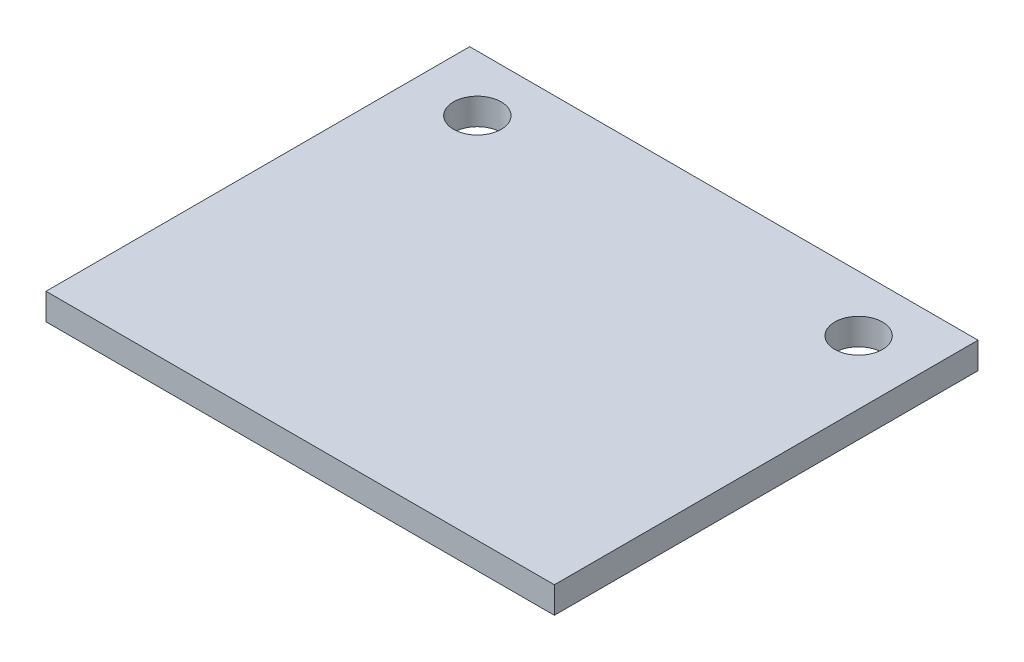
ISO-10303-21;
HEADER;
FILE_DESCRIPTION(('STEP AP214'),'2;1');
FILE_NAME('part.step','',(''),(''),'','','');
FILE_SCHEMA(('AUTOMOTIVE_DESIGN { 1 0 10303 214 1 1 1 1 }'));
ENDSEC;
DATA;
#1=APPLICATION_CONTEXT('core data for automotive mechanical design processes');
#2=APPLICATION_PROTOCOL_DEFINITION('international standard','automotive_design',2000,#1);
#3=PRODUCT_CONTEXT('',#1,'mechanical');
#4=PRODUCT('Part','Part','',(#3));
#5=PRODUCT_RELATED_PRODUCT_CATEGORY('part','',(#4));
#6=PRODUCT_DEFINITION_FORMATION('','',#4);
#7=PRODUCT_DEFINITION_CONTEXT('part definition',#1,'design');
#8=PRODUCT_DEFINITION('design','',#6,#7);
#9=PRODUCT_DEFINITION_SHAPE('','',#8);
#10=(LENGTH_UNIT() NAMED_UNIT(*) SI_UNIT(.MILLI.,.METRE.));
#11=(NAMED_UNIT(*) PLANE_ANGLE_UNIT() SI_UNIT($,.RADIAN.));
#12=(NAMED_UNIT(*) SI_UNIT($,.STERADIAN.) SOLID_ANGLE_UNIT());
#13=UNCERTAINTY_MEASURE_WITH_UNIT(LENGTH_MEASURE(1.E-05),#10,'distance_accuracy_value','');
#14=(GEOMETRIC_REPRESENTATION_CONTEXT(3) GLOBAL_UNCERTAINTY_ASSIGNED_CONTEXT((#13)) GLOBAL_UNIT_ASSIGNED_CONTEXT((#10,
#11,#12)) REPRESENTATION_CONTEXT('',''));
#15=CARTESIAN_POINT('',(0.,0.,0.));
#16=DIRECTION('',(0.,0.,1.));
#17=DIRECTION('',(1.,0.,0.));
#18=AXIS2_PLACEMENT_3D('',#15,#16,#17);
#19=CARTESIAN_POINT('',(0.,15.875,0.));
#20=DIRECTION('',(0.,1.,0.));
#21=DIRECTION('',(0.,0.,1.));
#22=AXIS2_PLACEMENT_3D('',#19,#20,#21);
#23=PLANE('',#22);
#24=DIRECTION('',(1.,0.,0.));
#25=VECTOR('',#24,1.);
#26=CARTESIAN_POINT('',(-152.4,15.875,-120.65));
#27=LINE('',#26,#25);
#28=CARTESIAN_POINT('',(-152.4,15.875,-120.65));
#29=VERTEX_POINT('',#28);
#30=CARTESIAN_POINT('',(152.4,15.875,-120.65));
#31=VERTEX_POINT('',#30);
#32=EDGE_CURVE('E109',#29,#31,#27,.T.);
#33=ORIENTED_EDGE('',*,*,#32,.F.);
#34=DIRECTION('',(0.,0.,1.));
#35=VECTOR('',#34,1.);
#36=CARTESIAN_POINT('',(-152.4,15.875,-133.35));
#37=LINE('',#36,#35);
#38=CARTESIAN_POINT('',(-152.4,15.875,133.35));
#39=VERTEX_POINT('',#38);
#40=EDGE_CURVE('E94',#29,#39,#37,.T.);
#41=ORIENTED_EDGE('',*,*,#40,.T.);
#42=DIRECTION('',(1.,0.,0.));
#43=VECTOR('',#42,1.);
#44=CARTESIAN_POINT('',(-152.4,15.875,133.35));
#45=LINE('',#44,#43);
#46=CARTESIAN_POINT('',(152.4,15.875,133.35));
#47=VERTEX_POINT('',#46);
#48=EDGE_CURVE('E57',#39,#47,#45,.T.);
#49=ORIENTED_EDGE('',*,*,#48,.T.);
#50=DIRECTION('',(0.,0.,-1.));
#51=VECTOR('',#50,1.);
#52=CARTESIAN_POINT('',(152.4,15.875,-133.35));
#53=LINE('',#52,#51);
#54=EDGE_CURVE('E77',#47,#31,#53,.T.);
#55=ORIENTED_EDGE('',*,*,#54,.T.);
#56=EDGE_LOOP('',(#33,#41,#49,#55));
#57=FACE_BOUND('',#56,.T.);
#58=CARTESIAN_POINT('',(-114.3,15.875,-87.1806612525036));
#59=DIRECTION('',(0.,1.,0.));
#60=DIRECTION('',(0.,0.,1.));
#61=AXIS2_PLACEMENT_3D('',#58,#59,#60);
#62=CIRCLE('',#61,14.2875);
#63=CARTESIAN_POINT('',(-114.3,15.875,-72.8931612525036));
#64=VERTEX_POINT('',#63);
#65=EDGE_CURVE('E86',#64,#64,#62,.T.);
#66=ORIENTED_EDGE('',*,*,#65,.F.);
#67=EDGE_LOOP('',(#66));
#68=FACE_BOUND('',#67,.T.);
#69=CARTESIAN_POINT('',(114.3,15.875,-87.1806612525036));
#70=DIRECTION('',(0.,1.,0.));
#71=DIRECTION('',(0.,0.,1.));
#72=AXIS2_PLACEMENT_3D('',#69,#70,#71);
#73=CIRCLE('',#72,14.2875);
#74=CARTESIAN_POINT('',(114.3,15.875,-72.8931612525037));
#75=VERTEX_POINT('',#74);
#76=EDGE_CURVE('E98',#75,#75,#73,.T.);
#77=ORIENTED_EDGE('',*,*,#76,.F.);
#78=EDGE_LOOP('',(#77));
#79=FACE_BOUND('',#78,.T.);
#80=ADVANCED_FACE('F33',(#57,#68,#79),#23,.T.);
#81=CARTESIAN_POINT('',(0.,0.,0.));
#82=DIRECTION('',(0.,1.,0.));
#83=DIRECTION('',(0.,0.,1.));
#84=AXIS2_PLACEMENT_3D('',#81,#82,#83);
#85=PLANE('',#84);
#86=DIRECTION('',(0.,0.,1.));
#87=VECTOR('',#86,1.);
#88=CARTESIAN_POINT('',(-152.4,0.,-133.35));
#89=LINE('',#88,#87);
#90=CARTESIAN_POINT('',(-152.4,0.,-120.65));
#91=VERTEX_POINT('',#90);
#92=CARTESIAN_POINT('',(-152.4,0.,133.35));
#93=VERTEX_POINT('',#92);
#94=EDGE_CURVE('E78',#91,#93,#89,.T.);
#95=ORIENTED_EDGE('',*,*,#94,.F.);
#96=DIRECTION('',(1.,0.,0.));
#97=VECTOR('',#96,1.);
#98=CARTESIAN_POINT('',(-152.4,0.,-120.65));
#99=LINE('',#98,#97);
#100=CARTESIAN_POINT('',(152.4,0.,-120.65));
#101=VERTEX_POINT('',#100);
#102=EDGE_CURVE('E48',#91,#101,#99,.T.);
#103=ORIENTED_EDGE('',*,*,#102,.T.);
#104=DIRECTION('',(0.,0.,-1.));
#105=VECTOR('',#104,1.);
#106=CARTESIAN_POINT('',(152.4,0.,-133.35));
#107=LINE('',#106,#105);
#108=CARTESIAN_POINT('',(152.4,0.,133.35));
#109=VERTEX_POINT('',#108);
#110=EDGE_CURVE('E83',#109,#101,#107,.T.);
#111=ORIENTED_EDGE('',*,*,#110,.F.);
#112=DIRECTION('',(1.,0.,0.));
#113=VECTOR('',#112,1.);
#114=CARTESIAN_POINT('',(-152.4,0.,133.35));
#115=LINE('',#114,#113);
#116=EDGE_CURVE('E69',#93,#109,#115,.T.);
#117=ORIENTED_EDGE('',*,*,#116,.F.);
#118=EDGE_LOOP('',(#95,#103,#111,#117));
#119=FACE_BOUND('',#118,.T.);
#120=CARTESIAN_POINT('',(-114.3,0.,-87.1806612525036));
#121=DIRECTION('',(0.,1.,0.));
#122=DIRECTION('',(0.,0.,1.));
#123=AXIS2_PLACEMENT_3D('',#120,#121,#122);
#124=CIRCLE('',#123,14.2875);
#125=CARTESIAN_POINT('',(-114.3,0.,-72.8931612525036));
#126=VERTEX_POINT('',#125);
#127=EDGE_CURVE('E90',#126,#126,#124,.T.);
#128=ORIENTED_EDGE('',*,*,#127,.T.);
#129=EDGE_LOOP('',(#128));
#130=FACE_BOUND('',#129,.T.);
#131=CARTESIAN_POINT('',(114.3,0.,-87.1806612525036));
#132=DIRECTION('',(0.,1.,0.));
#133=DIRECTION('',(0.,0.,1.));
#134=AXIS2_PLACEMENT_3D('',#131,#132,#133);
#135=CIRCLE('',#134,14.2875);
#136=CARTESIAN_POINT('',(114.3,0.,-72.8931612525037));
#137=VERTEX_POINT('',#136);
#138=EDGE_CURVE('E100',#137,#137,#135,.T.);
#139=ORIENTED_EDGE('',*,*,#138,.T.);
#140=EDGE_LOOP('',(#139));
#141=FACE_BOUND('',#140,.T.);
#142=ADVANCED_FACE('F84',(#119,#130,#141),#85,.F.);
#143=CARTESIAN_POINT('',(152.4,15.875,-133.35));
#144=DIRECTION('',(-1.,0.,0.));
#145=DIRECTION('',(0.,0.,1.));
#146=AXIS2_PLACEMENT_3D('',#143,#144,#145);
#147=PLANE('',#146);
#148=ORIENTED_EDGE('',*,*,#110,.T.);
#149=DIRECTION('',(0.,1.,0.));
#150=VECTOR('',#149,1.);
#151=CARTESIAN_POINT('',(152.4,0.,-120.65));
#152=LINE('',#151,#150);
#153=EDGE_CURVE('E103',#101,#31,#152,.T.);
#154=ORIENTED_EDGE('',*,*,#153,.T.);
#155=ORIENTED_EDGE('',*,*,#54,.F.);
#156=DIRECTION('',(0.,-1.,0.));
#157=VECTOR('',#156,1.);
#158=CARTESIAN_POINT('',(152.4,15.875,133.35));
#159=LINE('',#158,#157);
#160=EDGE_CURVE('E41',#47,#109,#159,.T.);
#161=ORIENTED_EDGE('',*,*,#160,.T.);
#162=EDGE_LOOP('',(#148,#154,#155,#161));
#163=FACE_BOUND('',#162,.T.);
#164=ADVANCED_FACE('F35',(#163),#147,.F.);
#165=CARTESIAN_POINT('',(-152.4,15.875,-133.35));
#166=DIRECTION('',(1.,0.,0.));
#167=DIRECTION('',(0.,0.,-1.));
#168=AXIS2_PLACEMENT_3D('',#165,#166,#167);
#169=PLANE('',#168);
#170=ORIENTED_EDGE('',*,*,#40,.F.);
#171=DIRECTION('',(0.,1.,0.));
#172=VECTOR('',#171,1.);
#173=CARTESIAN_POINT('',(-152.4,0.,-120.65));
#174=LINE('',#173,#172);
#175=EDGE_CURVE('E106',#91,#29,#174,.T.);
#176=ORIENTED_EDGE('',*,*,#175,.F.);
#177=ORIENTED_EDGE('',*,*,#94,.T.);
#178=DIRECTION('',(0.,-1.,0.));
#179=VECTOR('',#178,1.);
#180=CARTESIAN_POINT('',(-152.4,15.875,133.35));
#181=LINE('',#180,#179);
#182=EDGE_CURVE('E11',#39,#93,#181,.T.);
#183=ORIENTED_EDGE('',*,*,#182,.F.);
#184=EDGE_LOOP('',(#170,#176,#177,#183));
#185=FACE_BOUND('',#184,.T.);
#186=ADVANCED_FACE('F136',(#185),#169,.F.);
#187=CARTESIAN_POINT('',(-152.4,15.875,133.35));
#188=DIRECTION('',(0.,0.,-1.));
#189=DIRECTION('',(-1.,0.,0.));
#190=AXIS2_PLACEMENT_3D('',#187,#188,#189);
#191=PLANE('',#190);
#192=ORIENTED_EDGE('',*,*,#116,.T.);
#193=ORIENTED_EDGE('',*,*,#160,.F.);
#194=ORIENTED_EDGE('',*,*,#48,.F.);
#195=ORIENTED_EDGE('',*,*,#182,.T.);
#196=EDGE_LOOP('',(#192,#193,#194,#195));
#197=FACE_BOUND('',#196,.T.);
#198=ADVANCED_FACE('F71',(#197),#191,.F.);
#199=CARTESIAN_POINT('',(-114.3,15.875,-87.1806612525036));
#200=DIRECTION('',(0.,-1.,0.));
#201=DIRECTION('',(0.,0.,-1.));
#202=AXIS2_PLACEMENT_3D('',#199,#200,#201);
#203=CYLINDRICAL_SURFACE('',#202,14.2875);
#204=ORIENTED_EDGE('',*,*,#65,.T.);
#205=EDGE_LOOP('',(#204));
#206=FACE_BOUND('',#205,.T.);
#207=ORIENTED_EDGE('',*,*,#127,.F.);
#208=EDGE_LOOP('',(#207));
#209=FACE_BOUND('',#208,.T.);
#210=ADVANCED_FACE('F127',(#206,#209),#203,.F.);
#211=CARTESIAN_POINT('',(114.3,15.875,-87.1806612525036));
#212=DIRECTION('',(0.,-1.,0.));
#213=DIRECTION('',(0.,0.,-1.));
#214=AXIS2_PLACEMENT_3D('',#211,#212,#213);
#215=CYLINDRICAL_SURFACE('',#214,14.2875);
#216=ORIENTED_EDGE('',*,*,#76,.T.);
#217=EDGE_LOOP('',(#216));
#218=FACE_BOUND('',#217,.T.);
#219=ORIENTED_EDGE('',*,*,#138,.F.);
#220=EDGE_LOOP('',(#219));
#221=FACE_BOUND('',#220,.T.);
#222=ADVANCED_FACE('F124',(#218,#221),#215,.F.);
#223=CARTESIAN_POINT('',(-152.4,0.,-120.65));
#224=DIRECTION('',(0.,0.,1.));
#225=DIRECTION('',(1.,0.,0.));
#226=AXIS2_PLACEMENT_3D('',#223,#224,#225);
#227=PLANE('',#226);
#228=ORIENTED_EDGE('',*,*,#32,.T.);
#229=ORIENTED_EDGE('',*,*,#153,.F.);
#230=ORIENTED_EDGE('',*,*,#102,.F.);
#231=ORIENTED_EDGE('',*,*,#175,.T.);
#232=EDGE_LOOP('',(#228,#229,#230,#231));
#233=FACE_BOUND('',#232,.T.);
#234=ADVANCED_FACE('F114',(#233),#227,.F.);
#235=CLOSED_SHELL('',(#80,#142,#164,#186,#198,#210,#222,#234));
#236=MANIFOLD_SOLID_BREP('B2',#235);
#237=ADVANCED_BREP_SHAPE_REPRESENTATION('',(#18,#236),#14);
#238=SHAPE_DEFINITION_REPRESENTATION(#9,#237);
ENDSEC;
END-ISO-10303-21;
